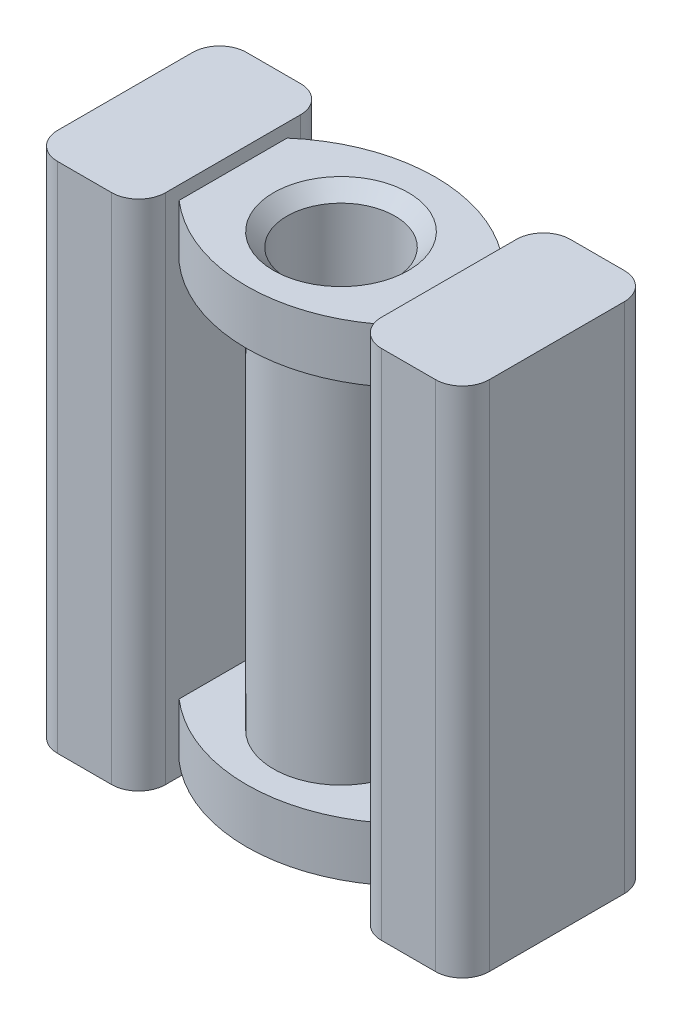
ISO-10303-21;
HEADER;
FILE_DESCRIPTION(('STEP AP214'),'2;1');
FILE_NAME('part.step','',(''),(''),'','','');
FILE_SCHEMA(('AUTOMOTIVE_DESIGN { 1 0 10303 214 1 1 1 1 }'));
ENDSEC;
DATA;
#1=APPLICATION_CONTEXT('core data for automotive mechanical design processes');
#2=APPLICATION_PROTOCOL_DEFINITION('international standard','automotive_design',2000,#1);
#3=PRODUCT_CONTEXT('',#1,'mechanical');
#4=PRODUCT('Part','Part','',(#3));
#5=PRODUCT_RELATED_PRODUCT_CATEGORY('part','',(#4));
#6=PRODUCT_DEFINITION_FORMATION('','',#4);
#7=PRODUCT_DEFINITION_CONTEXT('part definition',#1,'design');
#8=PRODUCT_DEFINITION('design','',#6,#7);
#9=PRODUCT_DEFINITION_SHAPE('','',#8);
#10=(LENGTH_UNIT() NAMED_UNIT(*) SI_UNIT(.MILLI.,.METRE.));
#11=(NAMED_UNIT(*) PLANE_ANGLE_UNIT() SI_UNIT($,.RADIAN.));
#12=(NAMED_UNIT(*) SI_UNIT($,.STERADIAN.) SOLID_ANGLE_UNIT());
#13=UNCERTAINTY_MEASURE_WITH_UNIT(LENGTH_MEASURE(1.E-05),#10,'distance_accuracy_value','');
#14=(GEOMETRIC_REPRESENTATION_CONTEXT(3) GLOBAL_UNCERTAINTY_ASSIGNED_CONTEXT((#13)) GLOBAL_UNIT_ASSIGNED_CONTEXT((#10,
#11,#12)) REPRESENTATION_CONTEXT('',''));
#15=CARTESIAN_POINT('',(0.,0.,0.));
#16=DIRECTION('',(0.,0.,1.));
#17=DIRECTION('',(1.,0.,0.));
#18=AXIS2_PLACEMENT_3D('',#15,#16,#17);
#19=CARTESIAN_POINT('',(0.,4.5,0.));
#20=DIRECTION('',(0.,-1.,0.));
#21=DIRECTION('',(0.,0.,-1.));
#22=AXIS2_PLACEMENT_3D('',#19,#20,#21);
#23=CYLINDRICAL_SURFACE('',#22,1.25);
#24=CARTESIAN_POINT('',(0.,-3.5,0.));
#25=DIRECTION('',(0.,-1.,0.));
#26=DIRECTION('',(0.,0.,-1.));
#27=AXIS2_PLACEMENT_3D('',#24,#25,#26);
#28=CIRCLE('',#27,1.25);
#29=CARTESIAN_POINT('',(0.,-3.5,-1.25));
#30=VERTEX_POINT('',#29);
#31=EDGE_CURVE('E263',#30,#30,#28,.T.);
#32=ORIENTED_EDGE('',*,*,#31,.F.);
#33=EDGE_LOOP('',(#32));
#34=FACE_BOUND('',#33,.T.);
#35=CARTESIAN_POINT('',(0.,3.5,0.));
#36=DIRECTION('',(0.,1.,0.));
#37=DIRECTION('',(0.,0.,1.));
#38=AXIS2_PLACEMENT_3D('',#35,#36,#37);
#39=CIRCLE('',#38,1.25);
#40=CARTESIAN_POINT('',(0.,3.5,1.25));
#41=VERTEX_POINT('',#40);
#42=EDGE_CURVE('E272',#41,#41,#39,.T.);
#43=ORIENTED_EDGE('',*,*,#42,.F.);
#44=EDGE_LOOP('',(#43));
#45=FACE_BOUND('',#44,.T.);
#46=ADVANCED_FACE('F41',(#34,#45),#23,.T.);
#47=CARTESIAN_POINT('',(0.,-4.5,1.29166666666667));
#48=DIRECTION('',(0.,1.,0.));
#49=DIRECTION('',(0.,0.,1.));
#50=AXIS2_PLACEMENT_3D('',#47,#48,#49);
#51=CYLINDRICAL_SURFACE('',#50,3.04166666666667);
#52=CARTESIAN_POINT('',(0.,-3.5,1.29166666666667));
#53=DIRECTION('',(0.,1.,0.));
#54=DIRECTION('',(0.,0.,-1.));
#55=AXIS2_PLACEMENT_3D('',#52,#53,#54);
#56=CIRCLE('',#55,3.04166666666667);
#57=CARTESIAN_POINT('',(2.,-3.5,-1.));
#58=VERTEX_POINT('',#57);
#59=CARTESIAN_POINT('',(-2.,-3.5,-1.));
#60=VERTEX_POINT('',#59);
#61=EDGE_CURVE('E251',#58,#60,#56,.T.);
#62=ORIENTED_EDGE('',*,*,#61,.F.);
#63=DIRECTION('',(0.,1.,0.));
#64=VECTOR('',#63,1.);
#65=CARTESIAN_POINT('',(2.,-4.5,-1.));
#66=LINE('',#65,#64);
#67=CARTESIAN_POINT('',(2.,-4.5,-1.));
#68=VERTEX_POINT('',#67);
#69=EDGE_CURVE('E260',#68,#58,#66,.T.);
#70=ORIENTED_EDGE('',*,*,#69,.F.);
#71=CARTESIAN_POINT('',(0.,-4.5,1.29166666666667));
#72=DIRECTION('',(0.,1.,0.));
#73=DIRECTION('',(0.,0.,-1.));
#74=AXIS2_PLACEMENT_3D('',#71,#72,#73);
#75=CIRCLE('',#74,3.04166666666667);
#76=CARTESIAN_POINT('',(-2.,-4.5,-1.));
#77=VERTEX_POINT('',#76);
#78=EDGE_CURVE('E238',#68,#77,#75,.T.);
#79=ORIENTED_EDGE('',*,*,#78,.T.);
#80=DIRECTION('',(0.,1.,0.));
#81=VECTOR('',#80,1.);
#82=CARTESIAN_POINT('',(-2.,-4.5,-1.));
#83=LINE('',#82,#81);
#84=EDGE_CURVE('E250',#77,#60,#83,.T.);
#85=ORIENTED_EDGE('',*,*,#84,.T.);
#86=EDGE_LOOP('',(#62,#70,#79,#85));
#87=FACE_BOUND('',#86,.T.);
#88=ADVANCED_FACE('F394',(#87),#51,.T.);
#89=CARTESIAN_POINT('',(0.,-4.5,-1.29166666666667));
#90=DIRECTION('',(0.,1.,0.));
#91=DIRECTION('',(0.,0.,1.));
#92=AXIS2_PLACEMENT_3D('',#89,#90,#91);
#93=CYLINDRICAL_SURFACE('',#92,3.04166666666667);
#94=CARTESIAN_POINT('',(0.,-3.5,-1.29166666666667));
#95=DIRECTION('',(0.,1.,0.));
#96=DIRECTION('',(0.,0.,1.));
#97=AXIS2_PLACEMENT_3D('',#94,#95,#96);
#98=CIRCLE('',#97,3.04166666666667);
#99=CARTESIAN_POINT('',(-2.,-3.5,1.));
#100=VERTEX_POINT('',#99);
#101=CARTESIAN_POINT('',(2.,-3.5,1.));
#102=VERTEX_POINT('',#101);
#103=EDGE_CURVE('E256',#100,#102,#98,.T.);
#104=ORIENTED_EDGE('',*,*,#103,.F.);
#105=DIRECTION('',(0.,1.,0.));
#106=VECTOR('',#105,1.);
#107=CARTESIAN_POINT('',(-2.,-4.5,1.));
#108=LINE('',#107,#106);
#109=CARTESIAN_POINT('',(-2.,-4.5,1.));
#110=VERTEX_POINT('',#109);
#111=EDGE_CURVE('E266',#110,#100,#108,.T.);
#112=ORIENTED_EDGE('',*,*,#111,.F.);
#113=CARTESIAN_POINT('',(0.,-4.5,-1.29166666666667));
#114=DIRECTION('',(0.,1.,0.));
#115=DIRECTION('',(0.,0.,1.));
#116=AXIS2_PLACEMENT_3D('',#113,#114,#115);
#117=CIRCLE('',#116,3.04166666666667);
#118=CARTESIAN_POINT('',(2.,-4.5,1.));
#119=VERTEX_POINT('',#118);
#120=EDGE_CURVE('E245',#110,#119,#117,.T.);
#121=ORIENTED_EDGE('',*,*,#120,.T.);
#122=DIRECTION('',(0.,1.,0.));
#123=VECTOR('',#122,1.);
#124=CARTESIAN_POINT('',(2.,-4.5,1.));
#125=LINE('',#124,#123);
#126=EDGE_CURVE('E264',#119,#102,#125,.T.);
#127=ORIENTED_EDGE('',*,*,#126,.T.);
#128=EDGE_LOOP('',(#104,#112,#121,#127));
#129=FACE_BOUND('',#128,.T.);
#130=ADVANCED_FACE('F387',(#129),#93,.T.);
#131=CARTESIAN_POINT('',(0.,-3.5,1.29166666666667));
#132=DIRECTION('',(0.,-1.,0.));
#133=DIRECTION('',(0.,0.,-1.));
#134=AXIS2_PLACEMENT_3D('',#131,#132,#133);
#135=PLANE('',#134);
#136=ORIENTED_EDGE('',*,*,#31,.T.);
#137=EDGE_LOOP('',(#136));
#138=FACE_BOUND('',#137,.T.);
#139=ORIENTED_EDGE('',*,*,#61,.T.);
#140=DIRECTION('',(0.,0.,1.));
#141=VECTOR('',#140,1.);
#142=CARTESIAN_POINT('',(-2.,-3.5,1.));
#143=LINE('',#142,#141);
#144=EDGE_CURVE('E254',#60,#100,#143,.T.);
#145=ORIENTED_EDGE('',*,*,#144,.T.);
#146=ORIENTED_EDGE('',*,*,#103,.T.);
#147=DIRECTION('',(0.,0.,-1.));
#148=VECTOR('',#147,1.);
#149=CARTESIAN_POINT('',(2.,-3.5,1.));
#150=LINE('',#149,#148);
#151=EDGE_CURVE('E242',#102,#58,#150,.T.);
#152=ORIENTED_EDGE('',*,*,#151,.T.);
#153=EDGE_LOOP('',(#139,#145,#146,#152));
#154=FACE_BOUND('',#153,.T.);
#155=ADVANCED_FACE('F376',(#138,#154),#135,.F.);
#156=CARTESIAN_POINT('',(0.,-4.5,0.));
#157=DIRECTION('',(0.,1.,0.));
#158=DIRECTION('',(0.,0.,1.));
#159=AXIS2_PLACEMENT_3D('',#156,#157,#158);
#160=PLANE('',#159);
#161=CARTESIAN_POINT('',(0.,-4.5,0.));
#162=DIRECTION('',(0.,1.,0.));
#163=DIRECTION('',(0.,0.,1.));
#164=AXIS2_PLACEMENT_3D('',#161,#162,#163);
#165=CIRCLE('',#164,1.25);
#166=CARTESIAN_POINT('',(0.,-4.5,1.25));
#167=VERTEX_POINT('',#166);
#168=EDGE_CURVE('E11',#167,#167,#165,.T.);
#169=ORIENTED_EDGE('',*,*,#168,.T.);
#170=EDGE_LOOP('',(#169));
#171=FACE_BOUND('',#170,.T.);
#172=ORIENTED_EDGE('',*,*,#78,.F.);
#173=DIRECTION('',(0.,0.,-1.));
#174=VECTOR('',#173,1.);
#175=CARTESIAN_POINT('',(2.,-4.5,1.));
#176=LINE('',#175,#174);
#177=EDGE_CURVE('E247',#119,#68,#176,.T.);
#178=ORIENTED_EDGE('',*,*,#177,.F.);
#179=ORIENTED_EDGE('',*,*,#120,.F.);
#180=DIRECTION('',(0.,0.,1.));
#181=VECTOR('',#180,1.);
#182=CARTESIAN_POINT('',(-2.,-4.5,1.));
#183=LINE('',#182,#181);
#184=EDGE_CURVE('E241',#77,#110,#183,.T.);
#185=ORIENTED_EDGE('',*,*,#184,.F.);
#186=EDGE_LOOP('',(#172,#178,#179,#185));
#187=FACE_BOUND('',#186,.T.);
#188=ADVANCED_FACE('F372',(#171,#187),#160,.F.);
#189=CARTESIAN_POINT('',(0.,4.5,1.29166666666667));
#190=DIRECTION('',(0.,-1.,0.));
#191=DIRECTION('',(0.,0.,-1.));
#192=AXIS2_PLACEMENT_3D('',#189,#190,#191);
#193=CYLINDRICAL_SURFACE('',#192,3.04166666666667);
#194=CARTESIAN_POINT('',(0.,3.5,1.29166666666667));
#195=DIRECTION('',(0.,1.,0.));
#196=DIRECTION('',(0.,0.,-1.));
#197=AXIS2_PLACEMENT_3D('',#194,#195,#196);
#198=CIRCLE('',#197,3.04166666666667);
#199=CARTESIAN_POINT('',(2.,3.5,-1.));
#200=VERTEX_POINT('',#199);
#201=CARTESIAN_POINT('',(-2.,3.5,-1.));
#202=VERTEX_POINT('',#201);
#203=EDGE_CURVE('E212',#200,#202,#198,.T.);
#204=ORIENTED_EDGE('',*,*,#203,.T.);
#205=DIRECTION('',(0.,-1.,0.));
#206=VECTOR('',#205,1.);
#207=CARTESIAN_POINT('',(-2.,4.5,-1.));
#208=LINE('',#207,#206);
#209=CARTESIAN_POINT('',(-2.,4.5,-1.));
#210=VERTEX_POINT('',#209);
#211=EDGE_CURVE('E232',#210,#202,#208,.T.);
#212=ORIENTED_EDGE('',*,*,#211,.F.);
#213=CARTESIAN_POINT('',(0.,4.5,1.29166666666667));
#214=DIRECTION('',(0.,1.,0.));
#215=DIRECTION('',(0.,0.,-1.));
#216=AXIS2_PLACEMENT_3D('',#213,#214,#215);
#217=CIRCLE('',#216,3.04166666666667);
#218=CARTESIAN_POINT('',(2.,4.5,-1.));
#219=VERTEX_POINT('',#218);
#220=EDGE_CURVE('E505',#219,#210,#217,.T.);
#221=ORIENTED_EDGE('',*,*,#220,.F.);
#222=DIRECTION('',(0.,-1.,0.));
#223=VECTOR('',#222,1.);
#224=CARTESIAN_POINT('',(2.,4.5,-1.));
#225=LINE('',#224,#223);
#226=EDGE_CURVE('E230',#219,#200,#225,.T.);
#227=ORIENTED_EDGE('',*,*,#226,.T.);
#228=EDGE_LOOP('',(#204,#212,#221,#227));
#229=FACE_BOUND('',#228,.T.);
#230=ADVANCED_FACE('F375',(#229),#193,.T.);
#231=CARTESIAN_POINT('',(0.,4.5,-1.29166666666667));
#232=DIRECTION('',(0.,-1.,0.));
#233=DIRECTION('',(0.,0.,-1.));
#234=AXIS2_PLACEMENT_3D('',#231,#232,#233);
#235=CYLINDRICAL_SURFACE('',#234,3.04166666666667);
#236=CARTESIAN_POINT('',(0.,3.5,-1.29166666666667));
#237=DIRECTION('',(0.,1.,0.));
#238=DIRECTION('',(0.,0.,1.));
#239=AXIS2_PLACEMENT_3D('',#236,#237,#238);
#240=CIRCLE('',#239,3.04166666666667);
#241=CARTESIAN_POINT('',(-2.,3.5,1.));
#242=VERTEX_POINT('',#241);
#243=CARTESIAN_POINT('',(2.,3.5,1.));
#244=VERTEX_POINT('',#243);
#245=EDGE_CURVE('E210',#242,#244,#240,.T.);
#246=ORIENTED_EDGE('',*,*,#245,.T.);
#247=DIRECTION('',(0.,-1.,0.));
#248=VECTOR('',#247,1.);
#249=CARTESIAN_POINT('',(2.,4.5,1.));
#250=LINE('',#249,#248);
#251=CARTESIAN_POINT('',(2.,4.5,1.));
#252=VERTEX_POINT('',#251);
#253=EDGE_CURVE('E221',#252,#244,#250,.T.);
#254=ORIENTED_EDGE('',*,*,#253,.F.);
#255=CARTESIAN_POINT('',(0.,4.5,-1.29166666666667));
#256=DIRECTION('',(0.,1.,0.));
#257=DIRECTION('',(0.,0.,1.));
#258=AXIS2_PLACEMENT_3D('',#255,#256,#257);
#259=CIRCLE('',#258,3.04166666666667);
#260=CARTESIAN_POINT('',(-2.,4.5,1.));
#261=VERTEX_POINT('',#260);
#262=EDGE_CURVE('E508',#261,#252,#259,.T.);
#263=ORIENTED_EDGE('',*,*,#262,.F.);
#264=DIRECTION('',(0.,-1.,0.));
#265=VECTOR('',#264,1.);
#266=CARTESIAN_POINT('',(-2.,4.5,1.));
#267=LINE('',#266,#265);
#268=EDGE_CURVE('E224',#261,#242,#267,.T.);
#269=ORIENTED_EDGE('',*,*,#268,.T.);
#270=EDGE_LOOP('',(#246,#254,#263,#269));
#271=FACE_BOUND('',#270,.T.);
#272=ADVANCED_FACE('F219',(#271),#235,.T.);
#273=CARTESIAN_POINT('',(0.,3.5,1.29166666666667));
#274=DIRECTION('',(0.,1.,0.));
#275=DIRECTION('',(0.,0.,-1.));
#276=AXIS2_PLACEMENT_3D('',#273,#274,#275);
#277=PLANE('',#276);
#278=ORIENTED_EDGE('',*,*,#42,.T.);
#279=EDGE_LOOP('',(#278));
#280=FACE_BOUND('',#279,.T.);
#281=ORIENTED_EDGE('',*,*,#203,.F.);
#282=DIRECTION('',(0.,0.,-1.));
#283=VECTOR('',#282,1.);
#284=CARTESIAN_POINT('',(2.,3.5,1.));
#285=LINE('',#284,#283);
#286=EDGE_CURVE('E206',#244,#200,#285,.T.);
#287=ORIENTED_EDGE('',*,*,#286,.F.);
#288=ORIENTED_EDGE('',*,*,#245,.F.);
#289=DIRECTION('',(0.,0.,1.));
#290=VECTOR('',#289,1.);
#291=CARTESIAN_POINT('',(-2.,3.5,1.));
#292=LINE('',#291,#290);
#293=EDGE_CURVE('E225',#202,#242,#292,.T.);
#294=ORIENTED_EDGE('',*,*,#293,.F.);
#295=EDGE_LOOP('',(#281,#287,#288,#294));
#296=FACE_BOUND('',#295,.T.);
#297=ADVANCED_FACE('F208',(#280,#296),#277,.F.);
#298=CARTESIAN_POINT('',(0.,4.5,0.));
#299=DIRECTION('',(0.,1.,0.));
#300=DIRECTION('',(0.,0.,1.));
#301=AXIS2_PLACEMENT_3D('',#298,#299,#300);
#302=PLANE('',#301);
#303=CARTESIAN_POINT('',(0.,4.5,0.));
#304=DIRECTION('',(0.,1.,0.));
#305=DIRECTION('',(0.,0.,1.));
#306=AXIS2_PLACEMENT_3D('',#303,#304,#305);
#307=CIRCLE('',#306,1.25);
#308=CARTESIAN_POINT('',(0.,4.5,1.25));
#309=VERTEX_POINT('',#308);
#310=EDGE_CURVE('E50',#309,#309,#307,.F.);
#311=ORIENTED_EDGE('',*,*,#310,.T.);
#312=EDGE_LOOP('',(#311));
#313=FACE_BOUND('',#312,.T.);
#314=ORIENTED_EDGE('',*,*,#220,.T.);
#315=DIRECTION('',(0.,0.,1.));
#316=VECTOR('',#315,1.);
#317=CARTESIAN_POINT('',(-2.,4.5,1.));
#318=LINE('',#317,#316);
#319=EDGE_CURVE('E234',#210,#261,#318,.T.);
#320=ORIENTED_EDGE('',*,*,#319,.T.);
#321=ORIENTED_EDGE('',*,*,#262,.T.);
#322=DIRECTION('',(0.,0.,-1.));
#323=VECTOR('',#322,1.);
#324=CARTESIAN_POINT('',(2.,4.5,1.));
#325=LINE('',#324,#323);
#326=EDGE_CURVE('E229',#252,#219,#325,.T.);
#327=ORIENTED_EDGE('',*,*,#326,.T.);
#328=EDGE_LOOP('',(#314,#320,#321,#327));
#329=FACE_BOUND('',#328,.T.);
#330=ADVANCED_FACE('F353',(#313,#329),#302,.T.);
#331=CARTESIAN_POINT('',(-2.,4.75,-1.75));
#332=DIRECTION('',(-1.,0.,0.));
#333=DIRECTION('',(0.,0.,1.));
#334=AXIS2_PLACEMENT_3D('',#331,#332,#333);
#335=PLANE('',#334);
#336=ORIENTED_EDGE('',*,*,#144,.F.);
#337=ORIENTED_EDGE('',*,*,#84,.F.);
#338=ORIENTED_EDGE('',*,*,#184,.T.);
#339=ORIENTED_EDGE('',*,*,#111,.T.);
#340=EDGE_LOOP('',(#336,#337,#338,#339));
#341=FACE_BOUND('',#340,.T.);
#342=DIRECTION('',(0.,0.,-1.));
#343=VECTOR('',#342,1.);
#344=CARTESIAN_POINT('',(-2.,4.75,-1.75));
#345=LINE('',#344,#343);
#346=CARTESIAN_POINT('',(-2.,4.75,1.25));
#347=VERTEX_POINT('',#346);
#348=CARTESIAN_POINT('',(-2.,4.75,-1.25));
#349=VERTEX_POINT('',#348);
#350=EDGE_CURVE('E492',#347,#349,#345,.T.);
#351=ORIENTED_EDGE('',*,*,#350,.F.);
#352=DIRECTION('',(0.,-1.,0.));
#353=VECTOR('',#352,1.);
#354=CARTESIAN_POINT('',(-2.,4.75,1.25));
#355=LINE('',#354,#353);
#356=CARTESIAN_POINT('',(-2.,-4.75,1.25));
#357=VERTEX_POINT('',#356);
#358=EDGE_CURVE('E308',#347,#357,#355,.T.);
#359=ORIENTED_EDGE('',*,*,#358,.T.);
#360=DIRECTION('',(0.,0.,-1.));
#361=VECTOR('',#360,1.);
#362=CARTESIAN_POINT('',(-2.,-4.75,-1.75));
#363=LINE('',#362,#361);
#364=CARTESIAN_POINT('',(-2.,-4.75,-1.25));
#365=VERTEX_POINT('',#364);
#366=EDGE_CURVE('E501',#357,#365,#363,.T.);
#367=ORIENTED_EDGE('',*,*,#366,.T.);
#368=DIRECTION('',(0.,-1.,0.));
#369=VECTOR('',#368,1.);
#370=CARTESIAN_POINT('',(-2.,4.75,-1.25));
#371=LINE('',#370,#369);
#372=EDGE_CURVE('E306',#365,#349,#371,.F.);
#373=ORIENTED_EDGE('',*,*,#372,.T.);
#374=EDGE_LOOP('',(#351,#359,#367,#373));
#375=FACE_BOUND('',#374,.T.);
#376=ORIENTED_EDGE('',*,*,#211,.T.);
#377=ORIENTED_EDGE('',*,*,#293,.T.);
#378=ORIENTED_EDGE('',*,*,#268,.F.);
#379=ORIENTED_EDGE('',*,*,#319,.F.);
#380=EDGE_LOOP('',(#376,#377,#378,#379));
#381=FACE_BOUND('',#380,.T.);
#382=ADVANCED_FACE('F392',(#341,#375,#381),#335,.F.);
#383=CARTESIAN_POINT('',(-4.,4.75,-1.75));
#384=DIRECTION('',(1.,0.,0.));
#385=DIRECTION('',(0.,0.,-1.));
#386=AXIS2_PLACEMENT_3D('',#383,#384,#385);
#387=PLANE('',#386);
#388=DIRECTION('',(0.,0.,1.));
#389=VECTOR('',#388,1.);
#390=CARTESIAN_POINT('',(-4.,-4.75,-1.75));
#391=LINE('',#390,#389);
#392=CARTESIAN_POINT('',(-4.,-4.75,-1.25));
#393=VERTEX_POINT('',#392);
#394=CARTESIAN_POINT('',(-4.,-4.75,1.25));
#395=VERTEX_POINT('',#394);
#396=EDGE_CURVE('E474',#393,#395,#391,.T.);
#397=ORIENTED_EDGE('',*,*,#396,.T.);
#398=DIRECTION('',(0.,-1.,0.));
#399=VECTOR('',#398,1.);
#400=CARTESIAN_POINT('',(-4.,4.75,1.25));
#401=LINE('',#400,#399);
#402=CARTESIAN_POINT('',(-4.,4.75,1.25));
#403=VERTEX_POINT('',#402);
#404=EDGE_CURVE('E334',#395,#403,#401,.F.);
#405=ORIENTED_EDGE('',*,*,#404,.T.);
#406=DIRECTION('',(0.,0.,1.));
#407=VECTOR('',#406,1.);
#408=CARTESIAN_POINT('',(-4.,4.75,-1.75));
#409=LINE('',#408,#407);
#410=CARTESIAN_POINT('',(-4.,4.75,-1.25));
#411=VERTEX_POINT('',#410);
#412=EDGE_CURVE('E485',#411,#403,#409,.T.);
#413=ORIENTED_EDGE('',*,*,#412,.F.);
#414=DIRECTION('',(0.,-1.,0.));
#415=VECTOR('',#414,1.);
#416=CARTESIAN_POINT('',(-4.,4.75,-1.25));
#417=LINE('',#416,#415);
#418=EDGE_CURVE('E331',#411,#393,#417,.T.);
#419=ORIENTED_EDGE('',*,*,#418,.T.);
#420=EDGE_LOOP('',(#397,#405,#413,#419));
#421=FACE_BOUND('',#420,.T.);
#422=ADVANCED_FACE('F538',(#421),#387,.F.);
#423=CARTESIAN_POINT('',(-4.,4.75,1.75));
#424=DIRECTION('',(0.,0.,-1.));
#425=DIRECTION('',(-1.,0.,0.));
#426=AXIS2_PLACEMENT_3D('',#423,#424,#425);
#427=PLANE('',#426);
#428=DIRECTION('',(1.,0.,0.));
#429=VECTOR('',#428,1.);
#430=CARTESIAN_POINT('',(-4.,-4.75,1.75));
#431=LINE('',#430,#429);
#432=CARTESIAN_POINT('',(-3.5,-4.75,1.75));
#433=VERTEX_POINT('',#432);
#434=CARTESIAN_POINT('',(-2.5,-4.75,1.75));
#435=VERTEX_POINT('',#434);
#436=EDGE_CURVE('E498',#433,#435,#431,.T.);
#437=ORIENTED_EDGE('',*,*,#436,.T.);
#438=DIRECTION('',(0.,-1.,0.));
#439=VECTOR('',#438,1.);
#440=CARTESIAN_POINT('',(-2.5,4.75,1.75));
#441=LINE('',#440,#439);
#442=CARTESIAN_POINT('',(-2.5,4.75,1.75));
#443=VERTEX_POINT('',#442);
#444=EDGE_CURVE('E322',#435,#443,#441,.F.);
#445=ORIENTED_EDGE('',*,*,#444,.T.);
#446=DIRECTION('',(1.,0.,0.));
#447=VECTOR('',#446,1.);
#448=CARTESIAN_POINT('',(-4.,4.75,1.75));
#449=LINE('',#448,#447);
#450=CARTESIAN_POINT('',(-3.5,4.75,1.75));
#451=VERTEX_POINT('',#450);
#452=EDGE_CURVE('E488',#451,#443,#449,.T.);
#453=ORIENTED_EDGE('',*,*,#452,.F.);
#454=DIRECTION('',(0.,-1.,0.));
#455=VECTOR('',#454,1.);
#456=CARTESIAN_POINT('',(-3.5,4.75,1.75));
#457=LINE('',#456,#455);
#458=EDGE_CURVE('E319',#451,#433,#457,.T.);
#459=ORIENTED_EDGE('',*,*,#458,.T.);
#460=EDGE_LOOP('',(#437,#445,#453,#459));
#461=FACE_BOUND('',#460,.T.);
#462=ADVANCED_FACE('F541',(#461),#427,.F.);
#463=CARTESIAN_POINT('',(-4.,4.75,-1.75));
#464=DIRECTION('',(0.,0.,1.));
#465=DIRECTION('',(1.,0.,0.));
#466=AXIS2_PLACEMENT_3D('',#463,#464,#465);
#467=PLANE('',#466);
#468=DIRECTION('',(-1.,0.,0.));
#469=VECTOR('',#468,1.);
#470=CARTESIAN_POINT('',(-4.,4.75,-1.75));
#471=LINE('',#470,#469);
#472=CARTESIAN_POINT('',(-2.5,4.75,-1.75));
#473=VERTEX_POINT('',#472);
#474=CARTESIAN_POINT('',(-3.5,4.75,-1.75));
#475=VERTEX_POINT('',#474);
#476=EDGE_CURVE('E494',#473,#475,#471,.T.);
#477=ORIENTED_EDGE('',*,*,#476,.F.);
#478=DIRECTION('',(0.,-1.,0.));
#479=VECTOR('',#478,1.);
#480=CARTESIAN_POINT('',(-2.5,4.75,-1.75));
#481=LINE('',#480,#479);
#482=CARTESIAN_POINT('',(-2.5,-4.75,-1.75));
#483=VERTEX_POINT('',#482);
#484=EDGE_CURVE('E337',#473,#483,#481,.T.);
#485=ORIENTED_EDGE('',*,*,#484,.T.);
#486=DIRECTION('',(-1.,0.,0.));
#487=VECTOR('',#486,1.);
#488=CARTESIAN_POINT('',(-4.,-4.75,-1.75));
#489=LINE('',#488,#487);
#490=CARTESIAN_POINT('',(-3.5,-4.75,-1.75));
#491=VERTEX_POINT('',#490);
#492=EDGE_CURVE('E489',#483,#491,#489,.T.);
#493=ORIENTED_EDGE('',*,*,#492,.T.);
#494=DIRECTION('',(0.,-1.,0.));
#495=VECTOR('',#494,1.);
#496=CARTESIAN_POINT('',(-3.5,4.75,-1.75));
#497=LINE('',#496,#495);
#498=EDGE_CURVE('E57',#491,#475,#497,.F.);
#499=ORIENTED_EDGE('',*,*,#498,.T.);
#500=EDGE_LOOP('',(#477,#485,#493,#499));
#501=FACE_BOUND('',#500,.T.);
#502=ADVANCED_FACE('F545',(#501),#467,.F.);
#503=CARTESIAN_POINT('',(0.,4.75,0.));
#504=DIRECTION('',(0.,1.,0.));
#505=DIRECTION('',(0.,0.,1.));
#506=AXIS2_PLACEMENT_3D('',#503,#504,#505);
#507=PLANE('',#506);
#508=ORIENTED_EDGE('',*,*,#452,.T.);
#509=CARTESIAN_POINT('',(-2.5,4.75,1.25));
#510=DIRECTION('',(0.,1.,0.));
#511=DIRECTION('',(0.,0.,1.));
#512=AXIS2_PLACEMENT_3D('',#509,#510,#511);
#513=CIRCLE('',#512,0.5);
#514=EDGE_CURVE('E329',#443,#347,#513,.T.);
#515=ORIENTED_EDGE('',*,*,#514,.T.);
#516=ORIENTED_EDGE('',*,*,#350,.T.);
#517=CARTESIAN_POINT('',(-2.5,4.75,-1.25));
#518=DIRECTION('',(0.,1.,0.));
#519=DIRECTION('',(0.,0.,1.));
#520=AXIS2_PLACEMENT_3D('',#517,#518,#519);
#521=CIRCLE('',#520,0.5);
#522=EDGE_CURVE('E64',#349,#473,#521,.T.);
#523=ORIENTED_EDGE('',*,*,#522,.T.);
#524=ORIENTED_EDGE('',*,*,#476,.T.);
#525=CARTESIAN_POINT('',(-3.5,4.75,-1.25));
#526=DIRECTION('',(0.,1.,0.));
#527=DIRECTION('',(0.,0.,1.));
#528=AXIS2_PLACEMENT_3D('',#525,#526,#527);
#529=CIRCLE('',#528,0.5);
#530=EDGE_CURVE('E324',#475,#411,#529,.T.);
#531=ORIENTED_EDGE('',*,*,#530,.T.);
#532=ORIENTED_EDGE('',*,*,#412,.T.);
#533=CARTESIAN_POINT('',(-3.5,4.75,1.25));
#534=DIRECTION('',(0.,1.,0.));
#535=DIRECTION('',(0.,0.,1.));
#536=AXIS2_PLACEMENT_3D('',#533,#534,#535);
#537=CIRCLE('',#536,0.5);
#538=EDGE_CURVE('E327',#403,#451,#537,.T.);
#539=ORIENTED_EDGE('',*,*,#538,.T.);
#540=EDGE_LOOP('',(#508,#515,#516,#523,#524,#531,#532,#539));
#541=FACE_BOUND('',#540,.T.);
#542=ADVANCED_FACE('F550',(#541),#507,.T.);
#543=CARTESIAN_POINT('',(0.,-4.75,0.));
#544=DIRECTION('',(0.,1.,0.));
#545=DIRECTION('',(0.,0.,1.));
#546=AXIS2_PLACEMENT_3D('',#543,#544,#545);
#547=PLANE('',#546);
#548=ORIENTED_EDGE('',*,*,#366,.F.);
#549=CARTESIAN_POINT('',(-2.5,-4.75,1.25));
#550=DIRECTION('',(0.,1.,0.));
#551=DIRECTION('',(0.,0.,1.));
#552=AXIS2_PLACEMENT_3D('',#549,#550,#551);
#553=CIRCLE('',#552,0.5);
#554=EDGE_CURVE('E317',#357,#435,#553,.F.);
#555=ORIENTED_EDGE('',*,*,#554,.T.);
#556=ORIENTED_EDGE('',*,*,#436,.F.);
#557=CARTESIAN_POINT('',(-3.5,-4.75,1.25));
#558=DIRECTION('',(0.,1.,0.));
#559=DIRECTION('',(0.,0.,1.));
#560=AXIS2_PLACEMENT_3D('',#557,#558,#559);
#561=CIRCLE('',#560,0.5);
#562=EDGE_CURVE('E315',#433,#395,#561,.F.);
#563=ORIENTED_EDGE('',*,*,#562,.T.);
#564=ORIENTED_EDGE('',*,*,#396,.F.);
#565=CARTESIAN_POINT('',(-3.5,-4.75,-1.25));
#566=DIRECTION('',(0.,1.,0.));
#567=DIRECTION('',(0.,0.,1.));
#568=AXIS2_PLACEMENT_3D('',#565,#566,#567);
#569=CIRCLE('',#568,0.5);
#570=EDGE_CURVE('E311',#393,#491,#569,.F.);
#571=ORIENTED_EDGE('',*,*,#570,.T.);
#572=ORIENTED_EDGE('',*,*,#492,.F.);
#573=CARTESIAN_POINT('',(-2.5,-4.75,-1.25));
#574=DIRECTION('',(0.,1.,0.));
#575=DIRECTION('',(0.,0.,1.));
#576=AXIS2_PLACEMENT_3D('',#573,#574,#575);
#577=CIRCLE('',#576,0.5);
#578=EDGE_CURVE('E313',#483,#365,#577,.F.);
#579=ORIENTED_EDGE('',*,*,#578,.T.);
#580=EDGE_LOOP('',(#548,#555,#556,#563,#564,#571,#572,#579));
#581=FACE_BOUND('',#580,.T.);
#582=ADVANCED_FACE('F551',(#581),#547,.F.);
#583=CARTESIAN_POINT('',(2.,4.75,-1.75));
#584=DIRECTION('',(-1.,0.,0.));
#585=DIRECTION('',(0.,0.,1.));
#586=AXIS2_PLACEMENT_3D('',#583,#584,#585);
#587=PLANE('',#586);
#588=DIRECTION('',(0.,0.,-1.));
#589=VECTOR('',#588,1.);
#590=CARTESIAN_POINT('',(2.,-4.75,-1.75));
#591=LINE('',#590,#589);
#592=CARTESIAN_POINT('',(2.,-4.75,1.25));
#593=VERTEX_POINT('',#592);
#594=CARTESIAN_POINT('',(2.,-4.75,-1.25));
#595=VERTEX_POINT('',#594);
#596=EDGE_CURVE('E480',#593,#595,#591,.T.);
#597=ORIENTED_EDGE('',*,*,#596,.F.);
#598=DIRECTION('',(0.,-1.,0.));
#599=VECTOR('',#598,1.);
#600=CARTESIAN_POINT('',(2.,4.75,1.25));
#601=LINE('',#600,#599);
#602=CARTESIAN_POINT('',(2.,4.75,1.25));
#603=VERTEX_POINT('',#602);
#604=EDGE_CURVE('E304',#593,#603,#601,.F.);
#605=ORIENTED_EDGE('',*,*,#604,.T.);
#606=DIRECTION('',(0.,0.,-1.));
#607=VECTOR('',#606,1.);
#608=CARTESIAN_POINT('',(2.,4.75,-1.75));
#609=LINE('',#608,#607);
#610=CARTESIAN_POINT('',(2.,4.75,-1.25));
#611=VERTEX_POINT('',#610);
#612=EDGE_CURVE('E464',#603,#611,#609,.T.);
#613=ORIENTED_EDGE('',*,*,#612,.T.);
#614=DIRECTION('',(0.,-1.,0.));
#615=VECTOR('',#614,1.);
#616=CARTESIAN_POINT('',(2.,4.75,-1.25));
#617=LINE('',#616,#615);
#618=EDGE_CURVE('E301',#611,#595,#617,.T.);
#619=ORIENTED_EDGE('',*,*,#618,.T.);
#620=EDGE_LOOP('',(#597,#605,#613,#619));
#621=FACE_BOUND('',#620,.T.);
#622=ORIENTED_EDGE('',*,*,#253,.T.);
#623=ORIENTED_EDGE('',*,*,#286,.T.);
#624=ORIENTED_EDGE('',*,*,#226,.F.);
#625=ORIENTED_EDGE('',*,*,#326,.F.);
#626=EDGE_LOOP('',(#622,#623,#624,#625));
#627=FACE_BOUND('',#626,.T.);
#628=ORIENTED_EDGE('',*,*,#151,.F.);
#629=ORIENTED_EDGE('',*,*,#126,.F.);
#630=ORIENTED_EDGE('',*,*,#177,.T.);
#631=ORIENTED_EDGE('',*,*,#69,.T.);
#632=EDGE_LOOP('',(#628,#629,#630,#631));
#633=FACE_BOUND('',#632,.T.);
#634=ADVANCED_FACE('F227',(#621,#627,#633),#587,.T.);
#635=CARTESIAN_POINT('',(4.,4.75,-1.75));
#636=DIRECTION('',(1.,0.,0.));
#637=DIRECTION('',(0.,0.,-1.));
#638=AXIS2_PLACEMENT_3D('',#635,#636,#637);
#639=PLANE('',#638);
#640=DIRECTION('',(0.,0.,1.));
#641=VECTOR('',#640,1.);
#642=CARTESIAN_POINT('',(4.,4.75,-1.75));
#643=LINE('',#642,#641);
#644=CARTESIAN_POINT('',(4.,4.75,-1.25));
#645=VERTEX_POINT('',#644);
#646=CARTESIAN_POINT('',(4.,4.75,1.25));
#647=VERTEX_POINT('',#646);
#648=EDGE_CURVE('E458',#645,#647,#643,.T.);
#649=ORIENTED_EDGE('',*,*,#648,.T.);
#650=DIRECTION('',(0.,-1.,0.));
#651=VECTOR('',#650,1.);
#652=CARTESIAN_POINT('',(4.,4.75,1.25));
#653=LINE('',#652,#651);
#654=CARTESIAN_POINT('',(4.,-4.75,1.25));
#655=VERTEX_POINT('',#654);
#656=EDGE_CURVE('E277',#647,#655,#653,.T.);
#657=ORIENTED_EDGE('',*,*,#656,.T.);
#658=DIRECTION('',(0.,0.,1.));
#659=VECTOR('',#658,1.);
#660=CARTESIAN_POINT('',(4.,-4.75,-1.75));
#661=LINE('',#660,#659);
#662=CARTESIAN_POINT('',(4.,-4.75,-1.25));
#663=VERTEX_POINT('',#662);
#664=EDGE_CURVE('E475',#663,#655,#661,.T.);
#665=ORIENTED_EDGE('',*,*,#664,.F.);
#666=DIRECTION('',(0.,-1.,0.));
#667=VECTOR('',#666,1.);
#668=CARTESIAN_POINT('',(4.,4.75,-1.25));
#669=LINE('',#668,#667);
#670=EDGE_CURVE('E275',#663,#645,#669,.F.);
#671=ORIENTED_EDGE('',*,*,#670,.T.);
#672=EDGE_LOOP('',(#649,#657,#665,#671));
#673=FACE_BOUND('',#672,.T.);
#674=ADVANCED_FACE('F557',(#673),#639,.T.);
#675=CARTESIAN_POINT('',(4.,4.75,-1.75));
#676=DIRECTION('',(0.,0.,-1.));
#677=DIRECTION('',(-1.,0.,0.));
#678=AXIS2_PLACEMENT_3D('',#675,#676,#677);
#679=PLANE('',#678);
#680=DIRECTION('',(1.,0.,0.));
#681=VECTOR('',#680,1.);
#682=CARTESIAN_POINT('',(4.,-4.75,-1.75));
#683=LINE('',#682,#681);
#684=CARTESIAN_POINT('',(2.5,-4.75,-1.75));
#685=VERTEX_POINT('',#684);
#686=CARTESIAN_POINT('',(3.5,-4.75,-1.75));
#687=VERTEX_POINT('',#686);
#688=EDGE_CURVE('E478',#685,#687,#683,.T.);
#689=ORIENTED_EDGE('',*,*,#688,.F.);
#690=DIRECTION('',(0.,-1.,0.));
#691=VECTOR('',#690,1.);
#692=CARTESIAN_POINT('',(2.5,4.75,-1.75));
#693=LINE('',#692,#691);
#694=CARTESIAN_POINT('',(2.5,4.75,-1.75));
#695=VERTEX_POINT('',#694);
#696=EDGE_CURVE('E343',#685,#695,#693,.F.);
#697=ORIENTED_EDGE('',*,*,#696,.T.);
#698=DIRECTION('',(1.,0.,0.));
#699=VECTOR('',#698,1.);
#700=CARTESIAN_POINT('',(4.,4.75,-1.75));
#701=LINE('',#700,#699);
#702=CARTESIAN_POINT('',(3.5,4.75,-1.75));
#703=VERTEX_POINT('',#702);
#704=EDGE_CURVE('E455',#695,#703,#701,.T.);
#705=ORIENTED_EDGE('',*,*,#704,.T.);
#706=DIRECTION('',(0.,-1.,0.));
#707=VECTOR('',#706,1.);
#708=CARTESIAN_POINT('',(3.5,4.75,-1.75));
#709=LINE('',#708,#707);
#710=EDGE_CURVE('E340',#703,#687,#709,.T.);
#711=ORIENTED_EDGE('',*,*,#710,.T.);
#712=EDGE_LOOP('',(#689,#697,#705,#711));
#713=FACE_BOUND('',#712,.T.);
#714=ADVANCED_FACE('F461',(#713),#679,.T.);
#715=CARTESIAN_POINT('',(4.,4.75,1.75));
#716=DIRECTION('',(0.,0.,1.));
#717=DIRECTION('',(1.,0.,0.));
#718=AXIS2_PLACEMENT_3D('',#715,#716,#717);
#719=PLANE('',#718);
#720=DIRECTION('',(-1.,0.,0.));
#721=VECTOR('',#720,1.);
#722=CARTESIAN_POINT('',(4.,-4.75,1.75));
#723=LINE('',#722,#721);
#724=CARTESIAN_POINT('',(3.5,-4.75,1.75));
#725=VERTEX_POINT('',#724);
#726=CARTESIAN_POINT('',(2.5,-4.75,1.75));
#727=VERTEX_POINT('',#726);
#728=EDGE_CURVE('E469',#725,#727,#723,.T.);
#729=ORIENTED_EDGE('',*,*,#728,.F.);
#730=DIRECTION('',(0.,-1.,0.));
#731=VECTOR('',#730,1.);
#732=CARTESIAN_POINT('',(3.5,4.75,1.75));
#733=LINE('',#732,#731);
#734=CARTESIAN_POINT('',(3.5,4.75,1.75));
#735=VERTEX_POINT('',#734);
#736=EDGE_CURVE('E291',#725,#735,#733,.F.);
#737=ORIENTED_EDGE('',*,*,#736,.T.);
#738=DIRECTION('',(-1.,0.,0.));
#739=VECTOR('',#738,1.);
#740=CARTESIAN_POINT('',(4.,4.75,1.75));
#741=LINE('',#740,#739);
#742=CARTESIAN_POINT('',(2.5,4.75,1.75));
#743=VERTEX_POINT('',#742);
#744=EDGE_CURVE('E467',#735,#743,#741,.T.);
#745=ORIENTED_EDGE('',*,*,#744,.T.);
#746=DIRECTION('',(0.,-1.,0.));
#747=VECTOR('',#746,1.);
#748=CARTESIAN_POINT('',(2.5,4.75,1.75));
#749=LINE('',#748,#747);
#750=EDGE_CURVE('E288',#743,#727,#749,.T.);
#751=ORIENTED_EDGE('',*,*,#750,.T.);
#752=EDGE_LOOP('',(#729,#737,#745,#751));
#753=FACE_BOUND('',#752,.T.);
#754=ADVANCED_FACE('F563',(#753),#719,.T.);
#755=CARTESIAN_POINT('',(0.,4.75,0.));
#756=DIRECTION('',(0.,1.,0.));
#757=DIRECTION('',(0.,0.,1.));
#758=AXIS2_PLACEMENT_3D('',#755,#756,#757);
#759=PLANE('',#758);
#760=ORIENTED_EDGE('',*,*,#744,.F.);
#761=CARTESIAN_POINT('',(3.5,4.75,1.25));
#762=DIRECTION('',(0.,1.,0.));
#763=DIRECTION('',(0.,0.,1.));
#764=AXIS2_PLACEMENT_3D('',#761,#762,#763);
#765=CIRCLE('',#764,0.5);
#766=EDGE_CURVE('E299',#735,#647,#765,.T.);
#767=ORIENTED_EDGE('',*,*,#766,.T.);
#768=ORIENTED_EDGE('',*,*,#648,.F.);
#769=CARTESIAN_POINT('',(3.5,4.75,-1.25));
#770=DIRECTION('',(0.,1.,0.));
#771=DIRECTION('',(0.,0.,1.));
#772=AXIS2_PLACEMENT_3D('',#769,#770,#771);
#773=CIRCLE('',#772,0.5);
#774=EDGE_CURVE('E293',#645,#703,#773,.T.);
#775=ORIENTED_EDGE('',*,*,#774,.T.);
#776=ORIENTED_EDGE('',*,*,#704,.F.);
#777=CARTESIAN_POINT('',(2.5,4.75,-1.25));
#778=DIRECTION('',(0.,1.,0.));
#779=DIRECTION('',(0.,0.,1.));
#780=AXIS2_PLACEMENT_3D('',#777,#778,#779);
#781=CIRCLE('',#780,0.5);
#782=EDGE_CURVE('E295',#695,#611,#781,.T.);
#783=ORIENTED_EDGE('',*,*,#782,.T.);
#784=ORIENTED_EDGE('',*,*,#612,.F.);
#785=CARTESIAN_POINT('',(2.5,4.75,1.25));
#786=DIRECTION('',(0.,1.,0.));
#787=DIRECTION('',(0.,0.,1.));
#788=AXIS2_PLACEMENT_3D('',#785,#786,#787);
#789=CIRCLE('',#788,0.5);
#790=EDGE_CURVE('E297',#603,#743,#789,.T.);
#791=ORIENTED_EDGE('',*,*,#790,.T.);
#792=EDGE_LOOP('',(#760,#767,#768,#775,#776,#783,#784,#791));
#793=FACE_BOUND('',#792,.T.);
#794=ADVANCED_FACE('F454',(#793),#759,.T.);
#795=CARTESIAN_POINT('',(0.,-4.75,0.));
#796=DIRECTION('',(0.,1.,0.));
#797=DIRECTION('',(0.,0.,1.));
#798=AXIS2_PLACEMENT_3D('',#795,#796,#797);
#799=PLANE('',#798);
#800=ORIENTED_EDGE('',*,*,#664,.T.);
#801=CARTESIAN_POINT('',(3.5,-4.75,1.25));
#802=DIRECTION('',(0.,1.,0.));
#803=DIRECTION('',(0.,0.,1.));
#804=AXIS2_PLACEMENT_3D('',#801,#802,#803);
#805=CIRCLE('',#804,0.5);
#806=EDGE_CURVE('E286',#655,#725,#805,.F.);
#807=ORIENTED_EDGE('',*,*,#806,.T.);
#808=ORIENTED_EDGE('',*,*,#728,.T.);
#809=CARTESIAN_POINT('',(2.5,-4.75,1.25));
#810=DIRECTION('',(0.,1.,0.));
#811=DIRECTION('',(0.,0.,1.));
#812=AXIS2_PLACEMENT_3D('',#809,#810,#811);
#813=CIRCLE('',#812,0.5);
#814=EDGE_CURVE('E284',#727,#593,#813,.F.);
#815=ORIENTED_EDGE('',*,*,#814,.T.);
#816=ORIENTED_EDGE('',*,*,#596,.T.);
#817=CARTESIAN_POINT('',(2.5,-4.75,-1.25));
#818=DIRECTION('',(0.,1.,0.));
#819=DIRECTION('',(0.,0.,1.));
#820=AXIS2_PLACEMENT_3D('',#817,#818,#819);
#821=CIRCLE('',#820,0.5);
#822=EDGE_CURVE('E282',#595,#685,#821,.F.);
#823=ORIENTED_EDGE('',*,*,#822,.T.);
#824=ORIENTED_EDGE('',*,*,#688,.T.);
#825=CARTESIAN_POINT('',(3.5,-4.75,-1.25));
#826=DIRECTION('',(0.,1.,0.));
#827=DIRECTION('',(0.,0.,1.));
#828=AXIS2_PLACEMENT_3D('',#825,#826,#827);
#829=CIRCLE('',#828,0.5);
#830=EDGE_CURVE('E280',#687,#663,#829,.F.);
#831=ORIENTED_EDGE('',*,*,#830,.T.);
#832=EDGE_LOOP('',(#800,#807,#808,#815,#816,#823,#824,#831));
#833=FACE_BOUND('',#832,.T.);
#834=ADVANCED_FACE('F412',(#833),#799,.F.);
#835=CARTESIAN_POINT('',(3.5,4.75,1.25));
#836=DIRECTION('',(0.,-1.,0.));
#837=DIRECTION('',(0.,0.,-1.));
#838=AXIS2_PLACEMENT_3D('',#835,#836,#837);
#839=CYLINDRICAL_SURFACE('',#838,0.5);
#840=ORIENTED_EDGE('',*,*,#766,.F.);
#841=ORIENTED_EDGE('',*,*,#736,.F.);
#842=ORIENTED_EDGE('',*,*,#806,.F.);
#843=ORIENTED_EDGE('',*,*,#656,.F.);
#844=EDGE_LOOP('',(#840,#841,#842,#843));
#845=FACE_BOUND('',#844,.T.);
#846=ADVANCED_FACE('F408',(#845),#839,.T.);
#847=CARTESIAN_POINT('',(2.5,4.75,1.25));
#848=DIRECTION('',(0.,-1.,0.));
#849=DIRECTION('',(0.,0.,-1.));
#850=AXIS2_PLACEMENT_3D('',#847,#848,#849);
#851=CYLINDRICAL_SURFACE('',#850,0.5);
#852=ORIENTED_EDGE('',*,*,#790,.F.);
#853=ORIENTED_EDGE('',*,*,#604,.F.);
#854=ORIENTED_EDGE('',*,*,#814,.F.);
#855=ORIENTED_EDGE('',*,*,#750,.F.);
#856=EDGE_LOOP('',(#852,#853,#854,#855));
#857=FACE_BOUND('',#856,.T.);
#858=ADVANCED_FACE('F411',(#857),#851,.T.);
#859=CARTESIAN_POINT('',(-2.5,4.75,1.25));
#860=DIRECTION('',(0.,-1.,0.));
#861=DIRECTION('',(0.,0.,-1.));
#862=AXIS2_PLACEMENT_3D('',#859,#860,#861);
#863=CYLINDRICAL_SURFACE('',#862,0.5);
#864=ORIENTED_EDGE('',*,*,#514,.F.);
#865=ORIENTED_EDGE('',*,*,#444,.F.);
#866=ORIENTED_EDGE('',*,*,#554,.F.);
#867=ORIENTED_EDGE('',*,*,#358,.F.);
#868=EDGE_LOOP('',(#864,#865,#866,#867));
#869=FACE_BOUND('',#868,.T.);
#870=ADVANCED_FACE('F416',(#869),#863,.T.);
#871=CARTESIAN_POINT('',(-3.5,4.75,1.25));
#872=DIRECTION('',(0.,-1.,0.));
#873=DIRECTION('',(0.,0.,-1.));
#874=AXIS2_PLACEMENT_3D('',#871,#872,#873);
#875=CYLINDRICAL_SURFACE('',#874,0.5);
#876=ORIENTED_EDGE('',*,*,#538,.F.);
#877=ORIENTED_EDGE('',*,*,#404,.F.);
#878=ORIENTED_EDGE('',*,*,#562,.F.);
#879=ORIENTED_EDGE('',*,*,#458,.F.);
#880=EDGE_LOOP('',(#876,#877,#878,#879));
#881=FACE_BOUND('',#880,.T.);
#882=ADVANCED_FACE('F420',(#881),#875,.T.);
#883=CARTESIAN_POINT('',(-2.5,4.75,-1.25));
#884=DIRECTION('',(0.,-1.,0.));
#885=DIRECTION('',(0.,0.,-1.));
#886=AXIS2_PLACEMENT_3D('',#883,#884,#885);
#887=CYLINDRICAL_SURFACE('',#886,0.5);
#888=ORIENTED_EDGE('',*,*,#522,.F.);
#889=ORIENTED_EDGE('',*,*,#372,.F.);
#890=ORIENTED_EDGE('',*,*,#578,.F.);
#891=ORIENTED_EDGE('',*,*,#484,.F.);
#892=EDGE_LOOP('',(#888,#889,#890,#891));
#893=FACE_BOUND('',#892,.T.);
#894=ADVANCED_FACE('F424',(#893),#887,.T.);
#895=CARTESIAN_POINT('',(-3.5,4.75,-1.25));
#896=DIRECTION('',(0.,-1.,0.));
#897=DIRECTION('',(0.,0.,-1.));
#898=AXIS2_PLACEMENT_3D('',#895,#896,#897);
#899=CYLINDRICAL_SURFACE('',#898,0.5);
#900=ORIENTED_EDGE('',*,*,#530,.F.);
#901=ORIENTED_EDGE('',*,*,#498,.F.);
#902=ORIENTED_EDGE('',*,*,#570,.F.);
#903=ORIENTED_EDGE('',*,*,#418,.F.);
#904=EDGE_LOOP('',(#900,#901,#902,#903));
#905=FACE_BOUND('',#904,.T.);
#906=ADVANCED_FACE('F428',(#905),#899,.T.);
#907=CARTESIAN_POINT('',(2.5,4.75,-1.25));
#908=DIRECTION('',(0.,-1.,0.));
#909=DIRECTION('',(0.,0.,-1.));
#910=AXIS2_PLACEMENT_3D('',#907,#908,#909);
#911=CYLINDRICAL_SURFACE('',#910,0.5);
#912=ORIENTED_EDGE('',*,*,#782,.F.);
#913=ORIENTED_EDGE('',*,*,#696,.F.);
#914=ORIENTED_EDGE('',*,*,#822,.F.);
#915=ORIENTED_EDGE('',*,*,#618,.F.);
#916=EDGE_LOOP('',(#912,#913,#914,#915));
#917=FACE_BOUND('',#916,.T.);
#918=ADVANCED_FACE('F432',(#917),#911,.T.);
#919=CARTESIAN_POINT('',(3.5,4.75,-1.25));
#920=DIRECTION('',(0.,-1.,0.));
#921=DIRECTION('',(0.,0.,-1.));
#922=AXIS2_PLACEMENT_3D('',#919,#920,#921);
#923=CYLINDRICAL_SURFACE('',#922,0.5);
#924=ORIENTED_EDGE('',*,*,#774,.F.);
#925=ORIENTED_EDGE('',*,*,#670,.F.);
#926=ORIENTED_EDGE('',*,*,#830,.F.);
#927=ORIENTED_EDGE('',*,*,#710,.F.);
#928=EDGE_LOOP('',(#924,#925,#926,#927));
#929=FACE_BOUND('',#928,.T.);
#930=ADVANCED_FACE('F364',(#929),#923,.T.);
#931=CARTESIAN_POINT('',(0.,4.5,0.));
#932=DIRECTION('',(0.,1.,0.));
#933=DIRECTION('',(0.,0.,1.));
#934=AXIS2_PLACEMENT_3D('',#931,#932,#933);
#935=CYLINDRICAL_SURFACE('',#934,0.999999999999998);
#936=CARTESIAN_POINT('',(0.,4.25,0.));
#937=DIRECTION('',(0.,1.,0.));
#938=DIRECTION('',(0.,0.,1.));
#939=AXIS2_PLACEMENT_3D('',#936,#937,#938);
#940=CIRCLE('',#939,0.999999999999998);
#941=CARTESIAN_POINT('',(0.,4.25,0.999999999999998));
#942=VERTEX_POINT('',#941);
#943=EDGE_CURVE('E348',#942,#942,#940,.T.);
#944=ORIENTED_EDGE('',*,*,#943,.T.);
#945=EDGE_LOOP('',(#944));
#946=FACE_BOUND('',#945,.T.);
#947=CARTESIAN_POINT('',(0.,-4.25,0.));
#948=DIRECTION('',(0.,1.,0.));
#949=DIRECTION('',(0.,0.,1.));
#950=AXIS2_PLACEMENT_3D('',#947,#948,#949);
#951=CIRCLE('',#950,0.999999999999998);
#952=CARTESIAN_POINT('',(0.,-4.25,0.999999999999998));
#953=VERTEX_POINT('',#952);
#954=EDGE_CURVE('E345',#953,#953,#951,.F.);
#955=ORIENTED_EDGE('',*,*,#954,.T.);
#956=EDGE_LOOP('',(#955));
#957=FACE_BOUND('',#956,.T.);
#958=ADVANCED_FACE('F359',(#946,#957),#935,.F.);
#959=CARTESIAN_POINT('',(0.,4.25,0.));
#960=DIRECTION('',(0.,1.,0.));
#961=DIRECTION('',(0.,0.,1.));
#962=AXIS2_PLACEMENT_3D('',#959,#960,#961);
#963=CONICAL_SURFACE('',#962,0.999999999999998,0.785398163397448);
#964=ORIENTED_EDGE('',*,*,#310,.F.);
#965=EDGE_LOOP('',(#964));
#966=FACE_BOUND('',#965,.T.);
#967=ORIENTED_EDGE('',*,*,#943,.F.);
#968=EDGE_LOOP('',(#967));
#969=FACE_BOUND('',#968,.T.);
#970=ADVANCED_FACE('F356',(#966,#969),#963,.F.);
#971=CARTESIAN_POINT('',(0.,-4.5,0.));
#972=DIRECTION('',(0.,-1.,0.));
#973=DIRECTION('',(0.,0.,-1.));
#974=AXIS2_PLACEMENT_3D('',#971,#972,#973);
#975=CONICAL_SURFACE('',#974,1.25,0.785398163397443);
#976=ORIENTED_EDGE('',*,*,#954,.F.);
#977=EDGE_LOOP('',(#976));
#978=FACE_BOUND('',#977,.T.);
#979=ORIENTED_EDGE('',*,*,#168,.F.);
#980=EDGE_LOOP('',(#979));
#981=FACE_BOUND('',#980,.T.);
#982=ADVANCED_FACE('F44',(#978,#981),#975,.F.);
#983=CLOSED_SHELL('',(#46,#88,#130,#155,#188,#230,#272,#297,#330,#382,#422,#462,#502,#542,#582,
#634,#674,#714,#754,#794,#834,#846,#858,#870,#882,#894,#906,#918,#930,#958,#970,#982));
#984=MANIFOLD_SOLID_BREP('B2',#983);
#985=ADVANCED_BREP_SHAPE_REPRESENTATION('',(#18,#984),#14);
#986=SHAPE_DEFINITION_REPRESENTATION(#9,#985);
ENDSEC;
END-ISO-10303-21;
